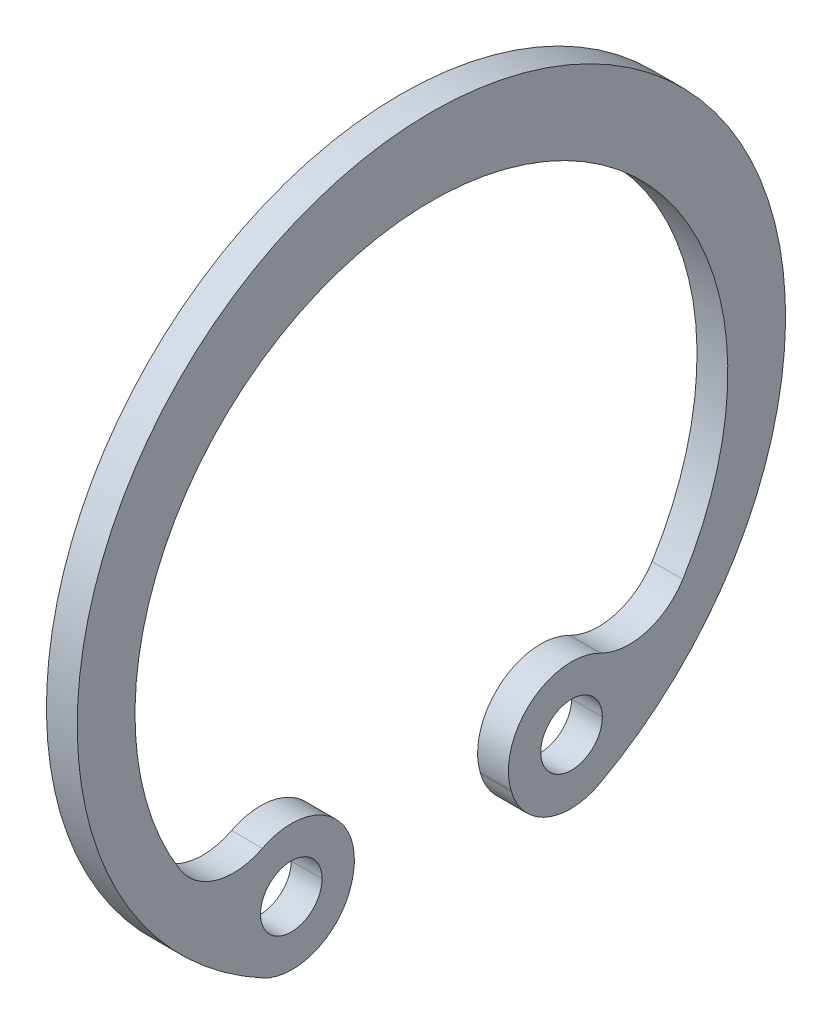
ISO-10303-21;
HEADER;
FILE_DESCRIPTION(('STEP AP214'),'2;1');
FILE_NAME('part.step','',(''),(''),'','','');
FILE_SCHEMA(('AUTOMOTIVE_DESIGN { 1 0 10303 214 1 1 1 1 }'));
ENDSEC;
DATA;
#1=APPLICATION_CONTEXT('core data for automotive mechanical design processes');
#2=APPLICATION_PROTOCOL_DEFINITION('international standard','automotive_design',2000,#1);
#3=PRODUCT_CONTEXT('',#1,'mechanical');
#4=PRODUCT('Part','Part','',(#3));
#5=PRODUCT_RELATED_PRODUCT_CATEGORY('part','',(#4));
#6=PRODUCT_DEFINITION_FORMATION('','',#4);
#7=PRODUCT_DEFINITION_CONTEXT('part definition',#1,'design');
#8=PRODUCT_DEFINITION('design','',#6,#7);
#9=PRODUCT_DEFINITION_SHAPE('','',#8);
#10=(LENGTH_UNIT() NAMED_UNIT(*) SI_UNIT(.MILLI.,.METRE.));
#11=(NAMED_UNIT(*) PLANE_ANGLE_UNIT() SI_UNIT($,.RADIAN.));
#12=(NAMED_UNIT(*) SI_UNIT($,.STERADIAN.) SOLID_ANGLE_UNIT());
#13=UNCERTAINTY_MEASURE_WITH_UNIT(LENGTH_MEASURE(1.E-05),#10,'distance_accuracy_value','');
#14=(GEOMETRIC_REPRESENTATION_CONTEXT(3) GLOBAL_UNCERTAINTY_ASSIGNED_CONTEXT((#13)) GLOBAL_UNIT_ASSIGNED_CONTEXT((#10,
#11,#12)) REPRESENTATION_CONTEXT('',''));
#15=CARTESIAN_POINT('',(0.,0.,0.));
#16=DIRECTION('',(0.,0.,1.));
#17=DIRECTION('',(1.,0.,0.));
#18=AXIS2_PLACEMENT_3D('',#15,#16,#17);
#19=CARTESIAN_POINT('',(0.5,-8.35614485396469,-4.51938526567201));
#20=DIRECTION('',(-1.,0.,0.));
#21=DIRECTION('',(0.,0.922739691980155,-0.385423741931357));
#22=AXIS2_PLACEMENT_3D('',#19,#20,#21);
#23=CYLINDRICAL_SURFACE('',#22,1.99999999999884);
#24=CARTESIAN_POINT('',(-0.5,-8.35614485396469,-4.51938526567201));
#25=DIRECTION('',(1.,0.,0.));
#26=DIRECTION('',(0.,0.,-1.));
#27=AXIS2_PLACEMENT_3D('',#24,#25,#26);
#28=CIRCLE('',#27,1.99999999999884);
#29=CARTESIAN_POINT('',(-0.5,-8.9159152274564,-2.5993183061739));
#30=VERTEX_POINT('',#29);
#31=CARTESIAN_POINT('',(-0.5,-10.115333244271,-5.4708347952882));
#32=VERTEX_POINT('',#31);
#33=EDGE_CURVE('E11',#30,#32,#28,.T.);
#34=ORIENTED_EDGE('',*,*,#33,.T.);
#35=DIRECTION('',(-1.,0.,0.));
#36=VECTOR('',#35,1.);
#37=CARTESIAN_POINT('',(0.5,-10.115333244271,-5.4708347952882));
#38=LINE('',#37,#36);
#39=CARTESIAN_POINT('',(0.5,-10.115333244271,-5.4708347952882));
#40=VERTEX_POINT('',#39);
#41=EDGE_CURVE('E25',#40,#32,#38,.T.);
#42=ORIENTED_EDGE('',*,*,#41,.F.);
#43=CARTESIAN_POINT('',(0.5,-8.35614485396469,-4.51938526567201));
#44=DIRECTION('',(1.,0.,0.));
#45=DIRECTION('',(0.,0.,-1.));
#46=AXIS2_PLACEMENT_3D('',#43,#44,#45);
#47=CIRCLE('',#46,1.99999999999884);
#48=CARTESIAN_POINT('',(0.5,-8.9159152274564,-2.5993183061739));
#49=VERTEX_POINT('',#48);
#50=EDGE_CURVE('E359',#49,#40,#47,.T.);
#51=ORIENTED_EDGE('',*,*,#50,.F.);
#52=DIRECTION('',(-1.,0.,0.));
#53=VECTOR('',#52,1.);
#54=CARTESIAN_POINT('',(0.5,-8.9159152274564,-2.5993183061739));
#55=LINE('',#54,#53);
#56=EDGE_CURVE('E355',#49,#30,#55,.T.);
#57=ORIENTED_EDGE('',*,*,#56,.T.);
#58=EDGE_LOOP('',(#34,#42,#51,#57));
#59=FACE_BOUND('',#58,.T.);
#60=ADVANCED_FACE('F17',(#59),#23,.T.);
#61=CARTESIAN_POINT('',(0.5,-8.8562763291698,-2.5819313665136));
#62=DIRECTION('',(0.,0.279885186746055,-0.9600334797496));
#63=DIRECTION('',(0.,0.9600334797496,0.279885186746055));
#64=AXIS2_PLACEMENT_3D('',#61,#62,#63);
#65=PLANE('',#64);
#66=DIRECTION('',(0.,-0.9600334797496,-0.279885186746055));
#67=VECTOR('',#66,1.);
#68=CARTESIAN_POINT('',(-0.5,-8.8562763291698,-2.5819313665136));
#69=LINE('',#68,#67);
#70=CARTESIAN_POINT('',(-0.5,-8.8562763291698,-2.5819313665136));
#71=VERTEX_POINT('',#70);
#72=EDGE_CURVE('E350',#71,#30,#69,.T.);
#73=ORIENTED_EDGE('',*,*,#72,.T.);
#74=ORIENTED_EDGE('',*,*,#56,.F.);
#75=DIRECTION('',(0.,-0.9600334797496,-0.279885186746055));
#76=VECTOR('',#75,1.);
#77=CARTESIAN_POINT('',(0.5,-8.8562763291698,-2.5819313665136));
#78=LINE('',#77,#76);
#79=CARTESIAN_POINT('',(0.5,-8.8562763291698,-2.5819313665136));
#80=VERTEX_POINT('',#79);
#81=EDGE_CURVE('E344',#80,#49,#78,.T.);
#82=ORIENTED_EDGE('',*,*,#81,.F.);
#83=DIRECTION('',(-1.,0.,0.));
#84=VECTOR('',#83,1.);
#85=CARTESIAN_POINT('',(0.5,-8.8562763291698,-2.5819313665136));
#86=LINE('',#85,#84);
#87=EDGE_CURVE('E339',#80,#71,#86,.T.);
#88=ORIENTED_EDGE('',*,*,#87,.T.);
#89=EDGE_LOOP('',(#73,#74,#82,#88));
#90=FACE_BOUND('',#89,.T.);
#91=ADVANCED_FACE('F377',(#90),#65,.F.);
#92=CARTESIAN_POINT('',(0.5,-8.28251169633942,-4.55));
#93=DIRECTION('',(-1.,0.,0.));
#94=DIRECTION('',(0.,-0.771452706473191,-0.636286666271727));
#95=AXIS2_PLACEMENT_3D('',#92,#93,#94);
#96=CYLINDRICAL_SURFACE('',#95,2.04999999999997);
#97=CARTESIAN_POINT('',(-0.5,-8.28251169633942,-4.55));
#98=DIRECTION('',(1.,0.,0.));
#99=DIRECTION('',(0.,0.,-1.));
#100=AXIS2_PLACEMENT_3D('',#97,#98,#99);
#101=CIRCLE('',#100,2.04999999999997);
#102=CARTESIAN_POINT('',(-0.5,-6.4595744916504,-5.4877632685067));
#103=VERTEX_POINT('',#102);
#104=EDGE_CURVE('E333',#103,#71,#101,.T.);
#105=ORIENTED_EDGE('',*,*,#104,.T.);
#106=ORIENTED_EDGE('',*,*,#87,.F.);
#107=CARTESIAN_POINT('',(0.5,-8.28251169633942,-4.55));
#108=DIRECTION('',(1.,0.,0.));
#109=DIRECTION('',(0.,0.,-1.));
#110=AXIS2_PLACEMENT_3D('',#107,#108,#109);
#111=CIRCLE('',#110,2.04999999999997);
#112=CARTESIAN_POINT('',(0.5,-6.4595744916504,-5.4877632685067));
#113=VERTEX_POINT('',#112);
#114=EDGE_CURVE('E327',#113,#80,#111,.T.);
#115=ORIENTED_EDGE('',*,*,#114,.F.);
#116=DIRECTION('',(-1.,0.,0.));
#117=VECTOR('',#116,1.);
#118=CARTESIAN_POINT('',(0.5,-6.4595744916504,-5.4877632685067));
#119=LINE('',#118,#117);
#120=EDGE_CURVE('E322',#113,#103,#119,.T.);
#121=ORIENTED_EDGE('',*,*,#120,.T.);
#122=EDGE_LOOP('',(#105,#106,#115,#121));
#123=FACE_BOUND('',#122,.T.);
#124=ADVANCED_FACE('F409',(#123),#96,.T.);
#125=CARTESIAN_POINT('',(0.5,-4.63663728696139,-6.42552653701331));
#126=DIRECTION('',(-1.,0.,0.));
#127=DIRECTION('',(0.,0.964095608375025,0.265555376356778));
#128=AXIS2_PLACEMENT_3D('',#125,#126,#127);
#129=CYLINDRICAL_SURFACE('',#128,2.0499999999999);
#130=CARTESIAN_POINT('',(-0.5,-4.63663728696139,-6.42552653701331));
#131=DIRECTION('',(1.,0.,0.));
#132=DIRECTION('',(0.,0.,-1.));
#133=AXIS2_PLACEMENT_3D('',#130,#131,#132);
#134=CIRCLE('',#133,2.0499999999999);
#135=CARTESIAN_POINT('',(-0.5,-5.7222949025745,-8.1644479100664));
#136=VERTEX_POINT('',#135);
#137=EDGE_CURVE('E316',#103,#136,#134,.T.);
#138=ORIENTED_EDGE('',*,*,#137,.F.);
#139=ORIENTED_EDGE('',*,*,#120,.F.);
#140=CARTESIAN_POINT('',(0.5,-4.63663728696139,-6.42552653701331));
#141=DIRECTION('',(1.,0.,0.));
#142=DIRECTION('',(0.,0.,-1.));
#143=AXIS2_PLACEMENT_3D('',#140,#141,#142);
#144=CIRCLE('',#143,2.0499999999999);
#145=CARTESIAN_POINT('',(0.5,-5.7222949025745,-8.1644479100664));
#146=VERTEX_POINT('',#145);
#147=EDGE_CURVE('E311',#113,#146,#144,.T.);
#148=ORIENTED_EDGE('',*,*,#147,.T.);
#149=DIRECTION('',(-1.,0.,0.));
#150=VECTOR('',#149,1.);
#151=CARTESIAN_POINT('',(0.5,-5.7222949025745,-8.1644479100664));
#152=LINE('',#151,#150);
#153=EDGE_CURVE('E306',#146,#136,#152,.T.);
#154=ORIENTED_EDGE('',*,*,#153,.T.);
#155=EDGE_LOOP('',(#138,#139,#148,#154));
#156=FACE_BOUND('',#155,.T.);
#157=ADVANCED_FACE('F406',(#156),#129,.F.);
#158=CARTESIAN_POINT('',(0.5,-0.624999999999986,0.));
#159=DIRECTION('',(-1.,0.,0.));
#160=DIRECTION('',(0.,-1.,0.));
#161=AXIS2_PLACEMENT_3D('',#158,#159,#160);
#162=CYLINDRICAL_SURFACE('',#161,9.625);
#163=CARTESIAN_POINT('',(-0.5,-0.624999999999986,0.));
#164=DIRECTION('',(1.,0.,0.));
#165=DIRECTION('',(0.,0.,-1.));
#166=AXIS2_PLACEMENT_3D('',#163,#164,#165);
#167=CIRCLE('',#166,9.625);
#168=CARTESIAN_POINT('',(-0.5,-5.7222949025745,8.1644479100664));
#169=VERTEX_POINT('',#168);
#170=EDGE_CURVE('E300',#136,#169,#167,.T.);
#171=ORIENTED_EDGE('',*,*,#170,.F.);
#172=ORIENTED_EDGE('',*,*,#153,.F.);
#173=CARTESIAN_POINT('',(0.5,-0.624999999999986,0.));
#174=DIRECTION('',(1.,0.,0.));
#175=DIRECTION('',(0.,0.,-1.));
#176=AXIS2_PLACEMENT_3D('',#173,#174,#175);
#177=CIRCLE('',#176,9.625);
#178=CARTESIAN_POINT('',(0.5,-5.7222949025745,8.1644479100664));
#179=VERTEX_POINT('',#178);
#180=EDGE_CURVE('E295',#146,#179,#177,.T.);
#181=ORIENTED_EDGE('',*,*,#180,.T.);
#182=DIRECTION('',(-1.,0.,0.));
#183=VECTOR('',#182,1.);
#184=CARTESIAN_POINT('',(0.5,-5.7222949025745,8.1644479100664));
#185=LINE('',#184,#183);
#186=EDGE_CURVE('E290',#179,#169,#185,.T.);
#187=ORIENTED_EDGE('',*,*,#186,.T.);
#188=EDGE_LOOP('',(#171,#172,#181,#187));
#189=FACE_BOUND('',#188,.T.);
#190=ADVANCED_FACE('F403',(#189),#162,.F.);
#191=CARTESIAN_POINT('',(0.5,-4.63663728696139,6.42552653701331));
#192=DIRECTION('',(-1.,0.,0.));
#193=DIRECTION('',(0.,0.964095608375026,-0.265555376356777));
#194=AXIS2_PLACEMENT_3D('',#191,#192,#193);
#195=CYLINDRICAL_SURFACE('',#194,2.0499999999999);
#196=CARTESIAN_POINT('',(-0.5,-4.63663728696139,6.42552653701331));
#197=DIRECTION('',(1.,0.,0.));
#198=DIRECTION('',(0.,0.,-1.));
#199=AXIS2_PLACEMENT_3D('',#196,#197,#198);
#200=CIRCLE('',#199,2.0499999999999);
#201=CARTESIAN_POINT('',(-0.5,-6.4595744916504,5.4877632685067));
#202=VERTEX_POINT('',#201);
#203=EDGE_CURVE('E284',#169,#202,#200,.T.);
#204=ORIENTED_EDGE('',*,*,#203,.F.);
#205=ORIENTED_EDGE('',*,*,#186,.F.);
#206=CARTESIAN_POINT('',(0.5,-4.63663728696139,6.42552653701331));
#207=DIRECTION('',(1.,0.,0.));
#208=DIRECTION('',(0.,0.,-1.));
#209=AXIS2_PLACEMENT_3D('',#206,#207,#208);
#210=CIRCLE('',#209,2.0499999999999);
#211=CARTESIAN_POINT('',(0.5,-6.4595744916504,5.4877632685067));
#212=VERTEX_POINT('',#211);
#213=EDGE_CURVE('E279',#179,#212,#210,.T.);
#214=ORIENTED_EDGE('',*,*,#213,.T.);
#215=DIRECTION('',(-1.,0.,0.));
#216=VECTOR('',#215,1.);
#217=CARTESIAN_POINT('',(0.5,-6.4595744916504,5.4877632685067));
#218=LINE('',#217,#216);
#219=EDGE_CURVE('E274',#212,#202,#218,.T.);
#220=ORIENTED_EDGE('',*,*,#219,.T.);
#221=EDGE_LOOP('',(#204,#205,#214,#220));
#222=FACE_BOUND('',#221,.T.);
#223=ADVANCED_FACE('F396',(#222),#195,.F.);
#224=CARTESIAN_POINT('',(0.5,-8.28251169633942,4.55));
#225=DIRECTION('',(-1.,0.,0.));
#226=DIRECTION('',(0.,-0.771452706473191,0.636286666271728));
#227=AXIS2_PLACEMENT_3D('',#224,#225,#226);
#228=CYLINDRICAL_SURFACE('',#227,2.04999999999997);
#229=CARTESIAN_POINT('',(-0.5,-8.28251169633942,4.55));
#230=DIRECTION('',(1.,0.,0.));
#231=DIRECTION('',(0.,0.,-1.));
#232=AXIS2_PLACEMENT_3D('',#229,#230,#231);
#233=CIRCLE('',#232,2.04999999999997);
#234=CARTESIAN_POINT('',(-0.5,-8.8562763291698,2.5819313665136));
#235=VERTEX_POINT('',#234);
#236=EDGE_CURVE('E268',#235,#202,#233,.T.);
#237=ORIENTED_EDGE('',*,*,#236,.T.);
#238=ORIENTED_EDGE('',*,*,#219,.F.);
#239=CARTESIAN_POINT('',(0.5,-8.28251169633942,4.55));
#240=DIRECTION('',(1.,0.,0.));
#241=DIRECTION('',(0.,0.,-1.));
#242=AXIS2_PLACEMENT_3D('',#239,#240,#241);
#243=CIRCLE('',#242,2.04999999999997);
#244=CARTESIAN_POINT('',(0.5,-8.8562763291698,2.5819313665136));
#245=VERTEX_POINT('',#244);
#246=EDGE_CURVE('E262',#245,#212,#243,.T.);
#247=ORIENTED_EDGE('',*,*,#246,.F.);
#248=DIRECTION('',(-1.,0.,0.));
#249=VECTOR('',#248,1.);
#250=CARTESIAN_POINT('',(0.5,-8.8562763291698,2.5819313665136));
#251=LINE('',#250,#249);
#252=EDGE_CURVE('E257',#245,#235,#251,.T.);
#253=ORIENTED_EDGE('',*,*,#252,.T.);
#254=EDGE_LOOP('',(#237,#238,#247,#253));
#255=FACE_BOUND('',#254,.T.);
#256=ADVANCED_FACE('F393',(#255),#228,.T.);
#257=CARTESIAN_POINT('',(0.5,-8.9159152274564,2.5993183061739));
#258=DIRECTION('',(0.,0.279885186746055,0.9600334797496));
#259=DIRECTION('',(0.,-0.9600334797496,0.279885186746055));
#260=AXIS2_PLACEMENT_3D('',#257,#258,#259);
#261=PLANE('',#260);
#262=DIRECTION('',(0.,0.9600334797496,-0.279885186746055));
#263=VECTOR('',#262,1.);
#264=CARTESIAN_POINT('',(-0.5,-8.9159152274564,2.5993183061739));
#265=LINE('',#264,#263);
#266=CARTESIAN_POINT('',(-0.5,-8.9159152274564,2.5993183061739));
#267=VERTEX_POINT('',#266);
#268=EDGE_CURVE('E252',#267,#235,#265,.T.);
#269=ORIENTED_EDGE('',*,*,#268,.T.);
#270=ORIENTED_EDGE('',*,*,#252,.F.);
#271=DIRECTION('',(0.,0.9600334797496,-0.279885186746055));
#272=VECTOR('',#271,1.);
#273=CARTESIAN_POINT('',(0.5,-8.9159152274564,2.5993183061739));
#274=LINE('',#273,#272);
#275=CARTESIAN_POINT('',(0.5,-8.9159152274564,2.5993183061739));
#276=VERTEX_POINT('',#275);
#277=EDGE_CURVE('E246',#276,#245,#274,.T.);
#278=ORIENTED_EDGE('',*,*,#277,.F.);
#279=DIRECTION('',(-1.,0.,0.));
#280=VECTOR('',#279,1.);
#281=CARTESIAN_POINT('',(0.5,-8.9159152274564,2.5993183061739));
#282=LINE('',#281,#280);
#283=EDGE_CURVE('E241',#276,#267,#282,.T.);
#284=ORIENTED_EDGE('',*,*,#283,.T.);
#285=EDGE_LOOP('',(#269,#270,#278,#284));
#286=FACE_BOUND('',#285,.T.);
#287=ADVANCED_FACE('F391',(#286),#261,.F.);
#288=CARTESIAN_POINT('',(0.5,-8.3561448539647,4.51938526567201));
#289=DIRECTION('',(-1.,0.,0.));
#290=DIRECTION('',(0.,0.922739691980155,0.385423741931357));
#291=AXIS2_PLACEMENT_3D('',#288,#289,#290);
#292=CYLINDRICAL_SURFACE('',#291,1.99999999999884);
#293=CARTESIAN_POINT('',(-0.5,-8.3561448539647,4.51938526567201));
#294=DIRECTION('',(1.,0.,0.));
#295=DIRECTION('',(0.,0.,-1.));
#296=AXIS2_PLACEMENT_3D('',#293,#294,#295);
#297=CIRCLE('',#296,1.99999999999884);
#298=CARTESIAN_POINT('',(-0.5,-10.115333244271,5.47083479528821));
#299=VERTEX_POINT('',#298);
#300=EDGE_CURVE('E235',#299,#267,#297,.T.);
#301=ORIENTED_EDGE('',*,*,#300,.T.);
#302=ORIENTED_EDGE('',*,*,#283,.F.);
#303=CARTESIAN_POINT('',(0.5,-8.3561448539647,4.51938526567201));
#304=DIRECTION('',(1.,0.,0.));
#305=DIRECTION('',(0.,0.,-1.));
#306=AXIS2_PLACEMENT_3D('',#303,#304,#305);
#307=CIRCLE('',#306,1.99999999999884);
#308=CARTESIAN_POINT('',(0.5,-10.115333244271,5.47083479528821));
#309=VERTEX_POINT('',#308);
#310=EDGE_CURVE('E229',#309,#276,#307,.T.);
#311=ORIENTED_EDGE('',*,*,#310,.F.);
#312=DIRECTION('',(-1.,0.,0.));
#313=VECTOR('',#312,1.);
#314=CARTESIAN_POINT('',(0.5,-10.115333244271,5.47083479528821));
#315=LINE('',#314,#313);
#316=EDGE_CURVE('E224',#309,#299,#315,.T.);
#317=ORIENTED_EDGE('',*,*,#316,.T.);
#318=EDGE_LOOP('',(#301,#302,#311,#317));
#319=FACE_BOUND('',#318,.T.);
#320=ADVANCED_FACE('F386',(#319),#292,.T.);
#321=CARTESIAN_POINT('',(0.5,2.27682456221956E-13,0.));
#322=DIRECTION('',(-1.,0.,0.));
#323=DIRECTION('',(0.,-1.,0.));
#324=AXIS2_PLACEMENT_3D('',#321,#322,#323);
#325=CYLINDRICAL_SURFACE('',#324,11.4999999999998);
#326=CARTESIAN_POINT('',(-0.5,2.27682456221956E-13,0.));
#327=DIRECTION('',(1.,0.,0.));
#328=DIRECTION('',(0.,0.,-1.));
#329=AXIS2_PLACEMENT_3D('',#326,#327,#328);
#330=CIRCLE('',#329,11.4999999999998);
#331=EDGE_CURVE('E218',#32,#299,#330,.T.);
#332=ORIENTED_EDGE('',*,*,#331,.T.);
#333=ORIENTED_EDGE('',*,*,#316,.F.);
#334=CARTESIAN_POINT('',(0.5,2.27682456221956E-13,0.));
#335=DIRECTION('',(1.,0.,0.));
#336=DIRECTION('',(0.,0.,-1.));
#337=AXIS2_PLACEMENT_3D('',#334,#335,#336);
#338=CIRCLE('',#337,11.4999999999998);
#339=EDGE_CURVE('E212',#40,#309,#338,.T.);
#340=ORIENTED_EDGE('',*,*,#339,.F.);
#341=ORIENTED_EDGE('',*,*,#41,.T.);
#342=EDGE_LOOP('',(#332,#333,#340,#341));
#343=FACE_BOUND('',#342,.T.);
#344=ADVANCED_FACE('F370',(#343),#325,.T.);
#345=CARTESIAN_POINT('',(0.5,-8.35614485396469,-4.51938526567201));
#346=DIRECTION('',(1.,0.,0.));
#347=DIRECTION('',(0.,0.,-1.));
#348=AXIS2_PLACEMENT_3D('',#345,#346,#347);
#349=PLANE('',#348);
#350=CARTESIAN_POINT('',(0.5,-8.2825116963395,4.55));
#351=DIRECTION('',(1.,0.,0.));
#352=DIRECTION('',(0.,0.,-1.));
#353=AXIS2_PLACEMENT_3D('',#350,#351,#352);
#354=CIRCLE('',#353,1.);
#355=CARTESIAN_POINT('',(0.5,-8.2825116963395,5.55));
#356=VERTEX_POINT('',#355);
#357=CARTESIAN_POINT('',(0.5,-8.2825116963395,3.55));
#358=VERTEX_POINT('',#357);
#359=EDGE_CURVE('E157',#356,#358,#354,.T.);
#360=ORIENTED_EDGE('',*,*,#359,.F.);
#361=CARTESIAN_POINT('',(0.5,-8.2825116963395,4.55));
#362=DIRECTION('',(1.,0.,0.));
#363=DIRECTION('',(0.,0.,-1.));
#364=AXIS2_PLACEMENT_3D('',#361,#362,#363);
#365=CIRCLE('',#364,1.);
#366=EDGE_CURVE('E203',#358,#356,#365,.T.);
#367=ORIENTED_EDGE('',*,*,#366,.F.);
#368=EDGE_LOOP('',(#360,#367));
#369=FACE_BOUND('',#368,.T.);
#370=CARTESIAN_POINT('',(0.5,-8.2825116963395,-4.55));
#371=DIRECTION('',(1.,0.,0.));
#372=DIRECTION('',(0.,0.,-1.));
#373=AXIS2_PLACEMENT_3D('',#370,#371,#372);
#374=CIRCLE('',#373,1.);
#375=CARTESIAN_POINT('',(0.5,-8.2825116963395,-3.55));
#376=VERTEX_POINT('',#375);
#377=CARTESIAN_POINT('',(0.5,-8.2825116963395,-5.55));
#378=VERTEX_POINT('',#377);
#379=EDGE_CURVE('E197',#376,#378,#374,.T.);
#380=ORIENTED_EDGE('',*,*,#379,.F.);
#381=CARTESIAN_POINT('',(0.5,-8.2825116963395,-4.55));
#382=DIRECTION('',(1.,0.,0.));
#383=DIRECTION('',(0.,0.,-1.));
#384=AXIS2_PLACEMENT_3D('',#381,#382,#383);
#385=CIRCLE('',#384,1.);
#386=EDGE_CURVE('E191',#378,#376,#385,.T.);
#387=ORIENTED_EDGE('',*,*,#386,.F.);
#388=EDGE_LOOP('',(#380,#387));
#389=FACE_BOUND('',#388,.T.);
#390=ORIENTED_EDGE('',*,*,#50,.T.);
#391=ORIENTED_EDGE('',*,*,#339,.T.);
#392=ORIENTED_EDGE('',*,*,#310,.T.);
#393=ORIENTED_EDGE('',*,*,#277,.T.);
#394=ORIENTED_EDGE('',*,*,#246,.T.);
#395=ORIENTED_EDGE('',*,*,#213,.F.);
#396=ORIENTED_EDGE('',*,*,#180,.F.);
#397=ORIENTED_EDGE('',*,*,#147,.F.);
#398=ORIENTED_EDGE('',*,*,#114,.T.);
#399=ORIENTED_EDGE('',*,*,#81,.T.);
#400=EDGE_LOOP('',(#390,#391,#392,#393,#394,#395,#396,#397,#398,#399));
#401=FACE_BOUND('',#400,.T.);
#402=ADVANCED_FACE('F374',(#369,#389,#401),#349,.T.);
#403=CARTESIAN_POINT('',(0.5,-8.2825116963395,-4.55));
#404=DIRECTION('',(-1.,0.,0.));
#405=DIRECTION('',(0.,-1.,0.));
#406=AXIS2_PLACEMENT_3D('',#403,#404,#405);
#407=CYLINDRICAL_SURFACE('',#406,1.);
#408=DIRECTION('',(-1.,0.,0.));
#409=VECTOR('',#408,1.);
#410=CARTESIAN_POINT('',(0.5,-8.2825116963395,-5.55));
#411=LINE('',#410,#409);
#412=CARTESIAN_POINT('',(-0.5,-8.2825116963395,-5.55));
#413=VERTEX_POINT('',#412);
#414=EDGE_CURVE('E186',#378,#413,#411,.T.);
#415=ORIENTED_EDGE('',*,*,#414,.F.);
#416=ORIENTED_EDGE('',*,*,#386,.T.);
#417=DIRECTION('',(-1.,0.,0.));
#418=VECTOR('',#417,1.);
#419=CARTESIAN_POINT('',(0.5,-8.2825116963395,-3.55));
#420=LINE('',#419,#418);
#421=CARTESIAN_POINT('',(-0.5,-8.2825116963395,-3.55));
#422=VERTEX_POINT('',#421);
#423=EDGE_CURVE('E181',#376,#422,#420,.T.);
#424=ORIENTED_EDGE('',*,*,#423,.T.);
#425=CARTESIAN_POINT('',(-0.5,-8.2825116963395,-4.55));
#426=DIRECTION('',(1.,0.,0.));
#427=DIRECTION('',(0.,0.,-1.));
#428=AXIS2_PLACEMENT_3D('',#425,#426,#427);
#429=CIRCLE('',#428,1.);
#430=EDGE_CURVE('E154',#413,#422,#429,.T.);
#431=ORIENTED_EDGE('',*,*,#430,.F.);
#432=EDGE_LOOP('',(#415,#416,#424,#431));
#433=FACE_BOUND('',#432,.T.);
#434=ADVANCED_FACE('F507',(#433),#407,.F.);
#435=CARTESIAN_POINT('',(-0.5,-8.35614485396469,-4.51938526567201));
#436=DIRECTION('',(1.,0.,0.));
#437=DIRECTION('',(0.,0.,-1.));
#438=AXIS2_PLACEMENT_3D('',#435,#436,#437);
#439=PLANE('',#438);
#440=CARTESIAN_POINT('',(-0.5,-8.2825116963395,4.55));
#441=DIRECTION('',(1.,0.,0.));
#442=DIRECTION('',(0.,0.,-1.));
#443=AXIS2_PLACEMENT_3D('',#440,#441,#442);
#444=CIRCLE('',#443,1.);
#445=CARTESIAN_POINT('',(-0.5,-8.2825116963395,3.55));
#446=VERTEX_POINT('',#445);
#447=CARTESIAN_POINT('',(-0.5,-8.2825116963395,5.55));
#448=VERTEX_POINT('',#447);
#449=EDGE_CURVE('E138',#446,#448,#444,.T.);
#450=ORIENTED_EDGE('',*,*,#449,.T.);
#451=CARTESIAN_POINT('',(-0.5,-8.2825116963395,4.55));
#452=DIRECTION('',(1.,0.,0.));
#453=DIRECTION('',(0.,0.,-1.));
#454=AXIS2_PLACEMENT_3D('',#451,#452,#453);
#455=CIRCLE('',#454,1.);
#456=EDGE_CURVE('E134',#448,#446,#455,.T.);
#457=ORIENTED_EDGE('',*,*,#456,.T.);
#458=EDGE_LOOP('',(#450,#457));
#459=FACE_BOUND('',#458,.T.);
#460=ORIENTED_EDGE('',*,*,#430,.T.);
#461=CARTESIAN_POINT('',(-0.5,-8.2825116963395,-4.55));
#462=DIRECTION('',(1.,0.,0.));
#463=DIRECTION('',(0.,0.,-1.));
#464=AXIS2_PLACEMENT_3D('',#461,#462,#463);
#465=CIRCLE('',#464,1.);
#466=EDGE_CURVE('E144',#422,#413,#465,.T.);
#467=ORIENTED_EDGE('',*,*,#466,.T.);
#468=EDGE_LOOP('',(#460,#467));
#469=FACE_BOUND('',#468,.T.);
#470=ORIENTED_EDGE('',*,*,#33,.F.);
#471=ORIENTED_EDGE('',*,*,#72,.F.);
#472=ORIENTED_EDGE('',*,*,#104,.F.);
#473=ORIENTED_EDGE('',*,*,#137,.T.);
#474=ORIENTED_EDGE('',*,*,#170,.T.);
#475=ORIENTED_EDGE('',*,*,#203,.T.);
#476=ORIENTED_EDGE('',*,*,#236,.F.);
#477=ORIENTED_EDGE('',*,*,#268,.F.);
#478=ORIENTED_EDGE('',*,*,#300,.F.);
#479=ORIENTED_EDGE('',*,*,#331,.F.);
#480=EDGE_LOOP('',(#470,#471,#472,#473,#474,#475,#476,#477,#478,#479));
#481=FACE_BOUND('',#480,.T.);
#482=ADVANCED_FACE('F136',(#459,#469,#481),#439,.F.);
#483=CARTESIAN_POINT('',(0.5,-8.2825116963395,-4.55));
#484=DIRECTION('',(-1.,0.,0.));
#485=DIRECTION('',(0.,1.,0.));
#486=AXIS2_PLACEMENT_3D('',#483,#484,#485);
#487=CYLINDRICAL_SURFACE('',#486,1.);
#488=ORIENTED_EDGE('',*,*,#414,.T.);
#489=ORIENTED_EDGE('',*,*,#466,.F.);
#490=ORIENTED_EDGE('',*,*,#423,.F.);
#491=ORIENTED_EDGE('',*,*,#379,.T.);
#492=EDGE_LOOP('',(#488,#489,#490,#491));
#493=FACE_BOUND('',#492,.T.);
#494=ADVANCED_FACE('F529',(#493),#487,.F.);
#495=CARTESIAN_POINT('',(0.5,-8.2825116963395,4.55));
#496=DIRECTION('',(-1.,0.,0.));
#497=DIRECTION('',(0.,1.,0.));
#498=AXIS2_PLACEMENT_3D('',#495,#496,#497);
#499=CYLINDRICAL_SURFACE('',#498,1.);
#500=DIRECTION('',(-1.,0.,0.));
#501=VECTOR('',#500,1.);
#502=CARTESIAN_POINT('',(0.5,-8.2825116963395,3.55));
#503=LINE('',#502,#501);
#504=EDGE_CURVE('E150',#358,#446,#503,.T.);
#505=ORIENTED_EDGE('',*,*,#504,.T.);
#506=ORIENTED_EDGE('',*,*,#456,.F.);
#507=DIRECTION('',(-1.,0.,0.));
#508=VECTOR('',#507,1.);
#509=CARTESIAN_POINT('',(0.5,-8.2825116963395,5.55));
#510=LINE('',#509,#508);
#511=EDGE_CURVE('E152',#356,#448,#510,.T.);
#512=ORIENTED_EDGE('',*,*,#511,.F.);
#513=ORIENTED_EDGE('',*,*,#359,.T.);
#514=EDGE_LOOP('',(#505,#506,#512,#513));
#515=FACE_BOUND('',#514,.T.);
#516=ADVANCED_FACE('F156',(#515),#499,.F.);
#517=CARTESIAN_POINT('',(0.5,-8.2825116963395,4.55));
#518=DIRECTION('',(-1.,0.,0.));
#519=DIRECTION('',(0.,-1.,0.));
#520=AXIS2_PLACEMENT_3D('',#517,#518,#519);
#521=CYLINDRICAL_SURFACE('',#520,1.);
#522=ORIENTED_EDGE('',*,*,#504,.F.);
#523=ORIENTED_EDGE('',*,*,#366,.T.);
#524=ORIENTED_EDGE('',*,*,#511,.T.);
#525=ORIENTED_EDGE('',*,*,#449,.F.);
#526=EDGE_LOOP('',(#522,#523,#524,#525));
#527=FACE_BOUND('',#526,.T.);
#528=ADVANCED_FACE('F148',(#527),#521,.F.);
#529=CLOSED_SHELL('',(#60,#91,#124,#157,#190,#223,#256,#287,#320,#344,#402,#434,#482,#494,#516,#528));
#530=MANIFOLD_SOLID_BREP('B1',#529);
#531=ADVANCED_BREP_SHAPE_REPRESENTATION('',(#18,#530),#14);
#532=SHAPE_DEFINITION_REPRESENTATION(#9,#531);
ENDSEC;
END-ISO-10303-21;
